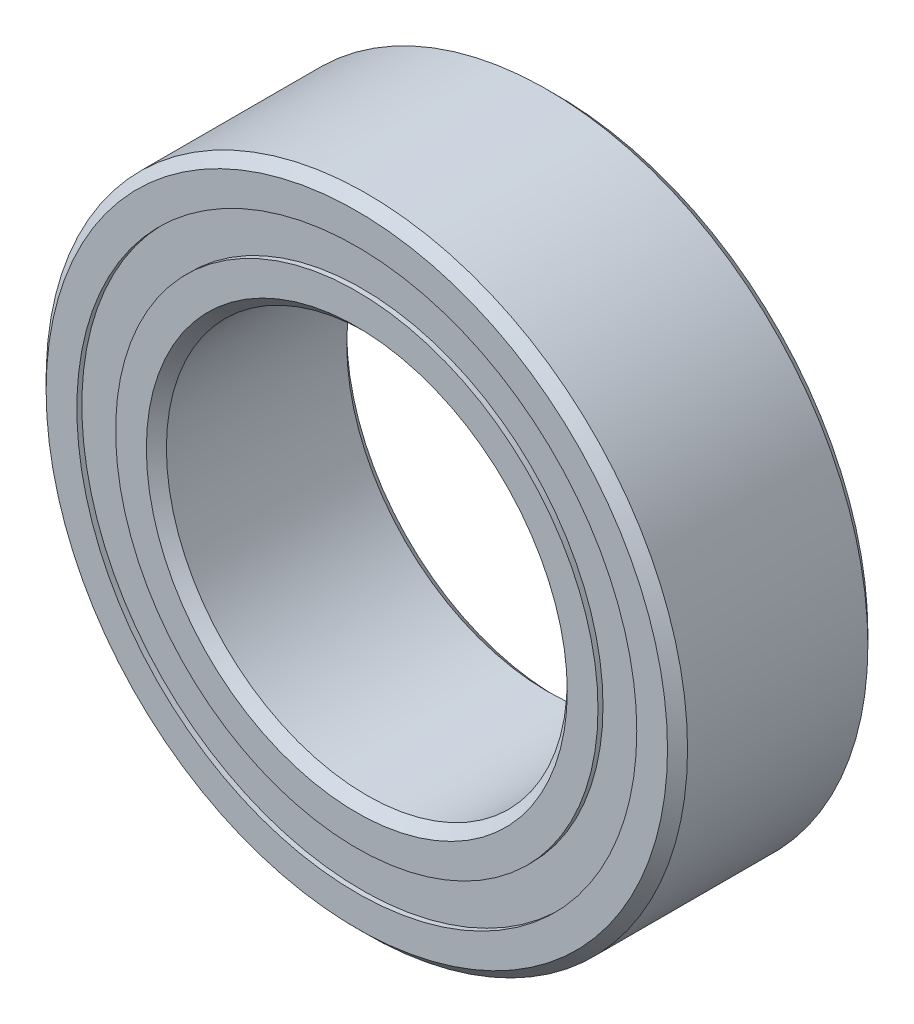
ISO-10303-21;
HEADER;
FILE_DESCRIPTION(('STEP AP214'),'2;1');
FILE_NAME('part.step','',(''),(''),'','','');
FILE_SCHEMA(('AUTOMOTIVE_DESIGN { 1 0 10303 214 1 1 1 1 }'));
ENDSEC;
DATA;
#1=APPLICATION_CONTEXT('core data for automotive mechanical design processes');
#2=APPLICATION_PROTOCOL_DEFINITION('international standard','automotive_design',2000,#1);
#3=PRODUCT_CONTEXT('',#1,'mechanical');
#4=PRODUCT('Part','Part','',(#3));
#5=PRODUCT_RELATED_PRODUCT_CATEGORY('part','',(#4));
#6=PRODUCT_DEFINITION_FORMATION('','',#4);
#7=PRODUCT_DEFINITION_CONTEXT('part definition',#1,'design');
#8=PRODUCT_DEFINITION('design','',#6,#7);
#9=PRODUCT_DEFINITION_SHAPE('','',#8);
#10=(LENGTH_UNIT() NAMED_UNIT(*) SI_UNIT(.MILLI.,.METRE.));
#11=(NAMED_UNIT(*) PLANE_ANGLE_UNIT() SI_UNIT($,.RADIAN.));
#12=(NAMED_UNIT(*) SI_UNIT($,.STERADIAN.) SOLID_ANGLE_UNIT());
#13=UNCERTAINTY_MEASURE_WITH_UNIT(LENGTH_MEASURE(1.E-05),#10,'distance_accuracy_value','');
#14=(GEOMETRIC_REPRESENTATION_CONTEXT(3) GLOBAL_UNCERTAINTY_ASSIGNED_CONTEXT((#13)) GLOBAL_UNIT_ASSIGNED_CONTEXT((#10,
#11,#12)) REPRESENTATION_CONTEXT('',''));
#15=CARTESIAN_POINT('',(0.,0.,0.));
#16=DIRECTION('',(0.,0.,1.));
#17=DIRECTION('',(1.,0.,0.));
#18=AXIS2_PLACEMENT_3D('',#15,#16,#17);
#19=CARTESIAN_POINT('',(0.,5.54322203296703,-1.884553));
#20=DIRECTION('',(0.,0.,1.));
#21=DIRECTION('',(1.,0.,0.));
#22=AXIS2_PLACEMENT_3D('',#19,#20,#21);
#23=PLANE('',#22);
#24=CARTESIAN_POINT('',(0.,0.,-1.884553));
#25=DIRECTION('',(0.,0.,1.));
#26=DIRECTION('',(1.,0.,0.));
#27=AXIS2_PLACEMENT_3D('',#24,#25,#26);
#28=CIRCLE('',#27,5.54322203296703);
#29=CARTESIAN_POINT('',(5.54322203296703,0.,-1.884553));
#30=VERTEX_POINT('',#29);
#31=EDGE_CURVE('E56',#30,#30,#28,.T.);
#32=ORIENTED_EDGE('',*,*,#31,.F.);
#33=EDGE_LOOP('',(#32));
#34=FACE_BOUND('',#33,.T.);
#35=CARTESIAN_POINT('',(0.,0.,-1.884553));
#36=DIRECTION('',(0.,0.,1.));
#37=DIRECTION('',(1.,0.,0.));
#38=AXIS2_PLACEMENT_3D('',#35,#36,#37);
#39=CIRCLE('',#38,4.77552796703297);
#40=CARTESIAN_POINT('',(4.77552796703297,0.,-1.884553));
#41=VERTEX_POINT('',#40);
#42=EDGE_CURVE('E11',#41,#41,#39,.T.);
#43=ORIENTED_EDGE('',*,*,#42,.T.);
#44=EDGE_LOOP('',(#43));
#45=FACE_BOUND('',#44,.T.);
#46=ADVANCED_FACE('F42',(#34,#45),#23,.F.);
#47=CARTESIAN_POINT('',(0.,0.,1.98374));
#48=DIRECTION('',(0.,0.,1.));
#49=DIRECTION('',(1.,0.,0.));
#50=AXIS2_PLACEMENT_3D('',#47,#48,#49);
#51=CYLINDRICAL_SURFACE('',#50,4.77552796703297);
#52=ORIENTED_EDGE('',*,*,#42,.F.);
#53=EDGE_LOOP('',(#52));
#54=FACE_BOUND('',#53,.T.);
#55=CARTESIAN_POINT('',(0.,0.,-0.961595974831125));
#56=DIRECTION('',(0.,0.,1.));
#57=DIRECTION('',(1.,0.,0.));
#58=AXIS2_PLACEMENT_3D('',#55,#56,#57);
#59=CIRCLE('',#58,4.77552796703297);
#60=CARTESIAN_POINT('',(4.77552796703297,0.,-0.961595974831125));
#61=VERTEX_POINT('',#60);
#62=EDGE_CURVE('E48',#61,#61,#59,.T.);
#63=ORIENTED_EDGE('',*,*,#62,.T.);
#64=EDGE_LOOP('',(#63));
#65=FACE_BOUND('',#64,.T.);
#66=ADVANCED_FACE('F65',(#54,#65),#51,.F.);
#67=CARTESIAN_POINT('',(0.,5.54322203296703,-0.961595974831125));
#68=DIRECTION('',(0.,0.,-1.));
#69=DIRECTION('',(-1.,0.,0.));
#70=AXIS2_PLACEMENT_3D('',#67,#68,#69);
#71=PLANE('',#70);
#72=ORIENTED_EDGE('',*,*,#62,.F.);
#73=EDGE_LOOP('',(#72));
#74=FACE_BOUND('',#73,.T.);
#75=CARTESIAN_POINT('',(0.,0.,-0.961595974831125));
#76=DIRECTION('',(0.,0.,1.));
#77=DIRECTION('',(1.,0.,0.));
#78=AXIS2_PLACEMENT_3D('',#75,#76,#77);
#79=CIRCLE('',#78,5.54322203296703);
#80=CARTESIAN_POINT('',(5.54322203296703,0.,-0.961595974831125));
#81=VERTEX_POINT('',#80);
#82=EDGE_CURVE('E52',#81,#81,#79,.T.);
#83=ORIENTED_EDGE('',*,*,#82,.T.);
#84=EDGE_LOOP('',(#83));
#85=FACE_BOUND('',#84,.T.);
#86=ADVANCED_FACE('F69',(#74,#85),#71,.F.);
#87=CARTESIAN_POINT('',(0.,0.,1.98374));
#88=DIRECTION('',(0.,0.,1.));
#89=DIRECTION('',(1.,0.,0.));
#90=AXIS2_PLACEMENT_3D('',#87,#88,#89);
#91=CYLINDRICAL_SURFACE('',#90,5.54322203296703);
#92=ORIENTED_EDGE('',*,*,#82,.F.);
#93=EDGE_LOOP('',(#92));
#94=FACE_BOUND('',#93,.T.);
#95=ORIENTED_EDGE('',*,*,#31,.T.);
#96=EDGE_LOOP('',(#95));
#97=FACE_BOUND('',#96,.T.);
#98=ADVANCED_FACE('F62',(#94,#97),#91,.T.);
#99=CLOSED_SHELL('',(#46,#66,#86,#98));
#100=MANIFOLD_SOLID_BREP('B2',#99);
#101=CARTESIAN_POINT('',(0.,5.54322203296703,1.884553));
#102=DIRECTION('',(0.,0.,-1.));
#103=DIRECTION('',(-1.,0.,0.));
#104=AXIS2_PLACEMENT_3D('',#101,#102,#103);
#105=PLANE('',#104);
#106=CARTESIAN_POINT('',(0.,0.,1.884553));
#107=DIRECTION('',(0.,0.,1.));
#108=DIRECTION('',(1.,0.,0.));
#109=AXIS2_PLACEMENT_3D('',#106,#107,#108);
#110=CIRCLE('',#109,4.77552796703297);
#111=CARTESIAN_POINT('',(4.77552796703297,0.,1.884553));
#112=VERTEX_POINT('',#111);
#113=EDGE_CURVE('E41',#112,#112,#110,.T.);
#114=ORIENTED_EDGE('',*,*,#113,.F.);
#115=EDGE_LOOP('',(#114));
#116=FACE_BOUND('',#115,.T.);
#117=CARTESIAN_POINT('',(0.,0.,1.884553));
#118=DIRECTION('',(0.,0.,1.));
#119=DIRECTION('',(1.,0.,0.));
#120=AXIS2_PLACEMENT_3D('',#117,#118,#119);
#121=CIRCLE('',#120,5.54322203296703);
#122=CARTESIAN_POINT('',(5.54322203296703,0.,1.884553));
#123=VERTEX_POINT('',#122);
#124=EDGE_CURVE('E124',#123,#123,#121,.T.);
#125=ORIENTED_EDGE('',*,*,#124,.T.);
#126=EDGE_LOOP('',(#125));
#127=FACE_BOUND('',#126,.T.);
#128=ADVANCED_FACE('F110',(#116,#127),#105,.F.);
#129=CARTESIAN_POINT('',(0.,0.,1.98374));
#130=DIRECTION('',(0.,0.,1.));
#131=DIRECTION('',(1.,0.,0.));
#132=AXIS2_PLACEMENT_3D('',#129,#130,#131);
#133=CYLINDRICAL_SURFACE('',#132,4.77552796703297);
#134=CARTESIAN_POINT('',(0.,0.,0.961595974831124));
#135=DIRECTION('',(0.,0.,1.));
#136=DIRECTION('',(1.,0.,0.));
#137=AXIS2_PLACEMENT_3D('',#134,#135,#136);
#138=CIRCLE('',#137,4.77552796703297);
#139=CARTESIAN_POINT('',(4.77552796703297,0.,0.961595974831124));
#140=VERTEX_POINT('',#139);
#141=EDGE_CURVE('E116',#140,#140,#138,.T.);
#142=ORIENTED_EDGE('',*,*,#141,.F.);
#143=EDGE_LOOP('',(#142));
#144=FACE_BOUND('',#143,.T.);
#145=ORIENTED_EDGE('',*,*,#113,.T.);
#146=EDGE_LOOP('',(#145));
#147=FACE_BOUND('',#146,.T.);
#148=ADVANCED_FACE('F139',(#144,#147),#133,.F.);
#149=CARTESIAN_POINT('',(0.,5.54322203296703,0.961595974831124));
#150=DIRECTION('',(0.,0.,1.));
#151=DIRECTION('',(1.,0.,0.));
#152=AXIS2_PLACEMENT_3D('',#149,#150,#151);
#153=PLANE('',#152);
#154=CARTESIAN_POINT('',(0.,0.,0.961595974831124));
#155=DIRECTION('',(0.,0.,1.));
#156=DIRECTION('',(1.,0.,0.));
#157=AXIS2_PLACEMENT_3D('',#154,#155,#156);
#158=CIRCLE('',#157,5.54322203296703);
#159=CARTESIAN_POINT('',(5.54322203296703,0.,0.961595974831124));
#160=VERTEX_POINT('',#159);
#161=EDGE_CURVE('E120',#160,#160,#158,.T.);
#162=ORIENTED_EDGE('',*,*,#161,.F.);
#163=EDGE_LOOP('',(#162));
#164=FACE_BOUND('',#163,.T.);
#165=ORIENTED_EDGE('',*,*,#141,.T.);
#166=EDGE_LOOP('',(#165));
#167=FACE_BOUND('',#166,.T.);
#168=ADVANCED_FACE('F134',(#164,#167),#153,.F.);
#169=CARTESIAN_POINT('',(0.,0.,1.98374));
#170=DIRECTION('',(0.,0.,1.));
#171=DIRECTION('',(1.,0.,0.));
#172=AXIS2_PLACEMENT_3D('',#169,#170,#171);
#173=CYLINDRICAL_SURFACE('',#172,5.54322203296703);
#174=ORIENTED_EDGE('',*,*,#124,.F.);
#175=EDGE_LOOP('',(#174));
#176=FACE_BOUND('',#175,.T.);
#177=ORIENTED_EDGE('',*,*,#161,.T.);
#178=EDGE_LOOP('',(#177));
#179=FACE_BOUND('',#178,.T.);
#180=ADVANCED_FACE('F131',(#176,#179),#173,.T.);
#181=CLOSED_SHELL('',(#128,#148,#168,#180));
#182=MANIFOLD_SOLID_BREP('B6',#181);
#183=CARTESIAN_POINT('',(-1.97440733385857,4.76664096305045,0.));
#184=DIRECTION('',(0.,0.,1.));
#185=DIRECTION('',(0.382683432365077,-0.923879532511292,0.));
#186=AXIS2_PLACEMENT_3D('',#183,#184,#185);
#187=SPHERICAL_SURFACE('',#186,0.961595974831125);
#188=CARTESIAN_POINT('',(-1.97440733385857,4.76664096305045,0.961595974831125));
#189=VERTEX_POINT('',#188);
#190=VERTEX_LOOP('',#189);
#191=FACE_BOUND('',#190,.T.);
#192=ADVANCED_FACE('F177',(#191),#187,.T.);
#193=CLOSED_SHELL('',(#192));
#194=MANIFOLD_SOLID_BREP('B36',#193);
#195=CARTESIAN_POINT('',(-3.6482290491843,3.64822904918439,0.));
#196=DIRECTION('',(0.,0.,1.));
#197=DIRECTION('',(0.707106781186539,-0.707106781186556,0.));
#198=AXIS2_PLACEMENT_3D('',#195,#196,#197);
#199=SPHERICAL_SURFACE('',#198,0.961595974831125);
#200=CARTESIAN_POINT('',(-3.6482290491843,3.64822904918439,0.961595974831125));
#201=VERTEX_POINT('',#200);
#202=VERTEX_LOOP('',#201);
#203=FACE_BOUND('',#202,.T.);
#204=ADVANCED_FACE('F197',(#203),#199,.T.);
#205=CLOSED_SHELL('',(#204));
#206=MANIFOLD_SOLID_BREP('B106',#205);
#207=CARTESIAN_POINT('',(-4.7666409630504,1.97440733385869,0.));
#208=DIRECTION('',(0.,0.,1.));
#209=DIRECTION('',(0.923879532511283,-0.3826834323651,0.));
#210=AXIS2_PLACEMENT_3D('',#207,#208,#209);
#211=SPHERICAL_SURFACE('',#210,0.961595974831125);
#212=CARTESIAN_POINT('',(-4.7666409630504,1.97440733385869,0.961595974831125));
#213=VERTEX_POINT('',#212);
#214=VERTEX_LOOP('',#213);
#215=FACE_BOUND('',#214,.T.);
#216=ADVANCED_FACE('F217',(#215),#211,.T.);
#217=CLOSED_SHELL('',(#216));
#218=MANIFOLD_SOLID_BREP('B173',#217);
#219=CARTESIAN_POINT('',(-5.159375,0.,0.));
#220=DIRECTION('',(0.,0.,1.));
#221=DIRECTION('',(1.,0.,0.));
#222=AXIS2_PLACEMENT_3D('',#219,#220,#221);
#223=SPHERICAL_SURFACE('',#222,0.961595974831125);
#224=CARTESIAN_POINT('',(-5.159375,0.,0.961595974831125));
#225=VERTEX_POINT('',#224);
#226=VERTEX_LOOP('',#225);
#227=FACE_BOUND('',#226,.T.);
#228=ADVANCED_FACE('F237',(#227),#223,.T.);
#229=CLOSED_SHELL('',(#228));
#230=MANIFOLD_SOLID_BREP('B193',#229);
#231=CARTESIAN_POINT('',(-4.76664096305044,-1.97440733385859,0.));
#232=DIRECTION('',(0.,0.,1.));
#233=DIRECTION('',(0.923879532511291,0.382683432365081,0.));
#234=AXIS2_PLACEMENT_3D('',#231,#232,#233);
#235=SPHERICAL_SURFACE('',#234,0.961595974831125);
#236=CARTESIAN_POINT('',(-4.76664096305044,-1.97440733385859,0.961595974831125));
#237=VERTEX_POINT('',#236);
#238=VERTEX_LOOP('',#237);
#239=FACE_BOUND('',#238,.T.);
#240=ADVANCED_FACE('F257',(#239),#235,.T.);
#241=CLOSED_SHELL('',(#240));
#242=MANIFOLD_SOLID_BREP('B213',#241);
#243=CARTESIAN_POINT('',(-3.64822904918437,-3.64822904918431,0.));
#244=DIRECTION('',(0.,0.,1.));
#245=DIRECTION('',(0.707106781186554,0.707106781186541,0.));
#246=AXIS2_PLACEMENT_3D('',#243,#244,#245);
#247=SPHERICAL_SURFACE('',#246,0.961595974831125);
#248=CARTESIAN_POINT('',(-3.64822904918437,-3.64822904918431,0.961595974831125));
#249=VERTEX_POINT('',#248);
#250=VERTEX_LOOP('',#249);
#251=FACE_BOUND('',#250,.T.);
#252=ADVANCED_FACE('F277',(#251),#247,.T.);
#253=CLOSED_SHELL('',(#252));
#254=MANIFOLD_SOLID_BREP('B233',#253);
#255=CARTESIAN_POINT('',(-1.97440733385867,-4.7666409630504,0.));
#256=DIRECTION('',(0.,0.,1.));
#257=DIRECTION('',(0.382683432365097,0.923879532511284,0.));
#258=AXIS2_PLACEMENT_3D('',#255,#256,#257);
#259=SPHERICAL_SURFACE('',#258,0.961595974831125);
#260=CARTESIAN_POINT('',(-1.97440733385867,-4.7666409630504,0.961595974831125));
#261=VERTEX_POINT('',#260);
#262=VERTEX_LOOP('',#261);
#263=FACE_BOUND('',#262,.T.);
#264=ADVANCED_FACE('F297',(#263),#259,.T.);
#265=CLOSED_SHELL('',(#264));
#266=MANIFOLD_SOLID_BREP('B253',#265);
#267=CARTESIAN_POINT('',(0.,-5.159375,0.));
#268=DIRECTION('',(0.,0.,1.));
#269=DIRECTION('',(0.,1.,0.));
#270=AXIS2_PLACEMENT_3D('',#267,#268,#269);
#271=SPHERICAL_SURFACE('',#270,0.961595974831125);
#272=CARTESIAN_POINT('',(0.,-5.159375,0.961595974831125));
#273=VERTEX_POINT('',#272);
#274=VERTEX_LOOP('',#273);
#275=FACE_BOUND('',#274,.T.);
#276=ADVANCED_FACE('F317',(#275),#271,.T.);
#277=CLOSED_SHELL('',(#276));
#278=MANIFOLD_SOLID_BREP('B273',#277);
#279=CARTESIAN_POINT('',(1.97440733385861,-4.76664096305043,0.));
#280=DIRECTION('',(0.,0.,1.));
#281=DIRECTION('',(-0.382683432365084,0.923879532511289,0.));
#282=AXIS2_PLACEMENT_3D('',#279,#280,#281);
#283=SPHERICAL_SURFACE('',#282,0.961595974831125);
#284=CARTESIAN_POINT('',(1.97440733385861,-4.76664096305043,0.961595974831125));
#285=VERTEX_POINT('',#284);
#286=VERTEX_LOOP('',#285);
#287=FACE_BOUND('',#286,.T.);
#288=ADVANCED_FACE('F337',(#287),#283,.T.);
#289=CLOSED_SHELL('',(#288));
#290=MANIFOLD_SOLID_BREP('B293',#289);
#291=CARTESIAN_POINT('',(3.64822904918432,-3.64822904918436,0.));
#292=DIRECTION('',(0.,0.,1.));
#293=DIRECTION('',(-0.707106781186544,0.707106781186551,0.));
#294=AXIS2_PLACEMENT_3D('',#291,#292,#293);
#295=SPHERICAL_SURFACE('',#294,0.961595974831125);
#296=CARTESIAN_POINT('',(3.64822904918432,-3.64822904918436,0.961595974831125));
#297=VERTEX_POINT('',#296);
#298=VERTEX_LOOP('',#297);
#299=FACE_BOUND('',#298,.T.);
#300=ADVANCED_FACE('F357',(#299),#295,.T.);
#301=CLOSED_SHELL('',(#300));
#302=MANIFOLD_SOLID_BREP('B313',#301);
#303=CARTESIAN_POINT('',(4.76664096305041,-1.97440733385866,0.));
#304=DIRECTION('',(0.,0.,1.));
#305=DIRECTION('',(-0.923879532511285,0.382683432365094,0.));
#306=AXIS2_PLACEMENT_3D('',#303,#304,#305);
#307=SPHERICAL_SURFACE('',#306,0.961595974831125);
#308=CARTESIAN_POINT('',(4.76664096305041,-1.97440733385866,0.961595974831125));
#309=VERTEX_POINT('',#308);
#310=VERTEX_LOOP('',#309);
#311=FACE_BOUND('',#310,.T.);
#312=ADVANCED_FACE('F377',(#311),#307,.T.);
#313=CLOSED_SHELL('',(#312));
#314=MANIFOLD_SOLID_BREP('B333',#313);
#315=CARTESIAN_POINT('',(5.159375,0.,0.));
#316=DIRECTION('',(0.,0.,1.));
#317=DIRECTION('',(-1.,0.,0.));
#318=AXIS2_PLACEMENT_3D('',#315,#316,#317);
#319=SPHERICAL_SURFACE('',#318,0.961595974831125);
#320=CARTESIAN_POINT('',(5.159375,0.,0.961595974831125));
#321=VERTEX_POINT('',#320);
#322=VERTEX_LOOP('',#321);
#323=FACE_BOUND('',#322,.T.);
#324=ADVANCED_FACE('F397',(#323),#319,.T.);
#325=CLOSED_SHELL('',(#324));
#326=MANIFOLD_SOLID_BREP('B353',#325);
#327=CARTESIAN_POINT('',(4.76664096305042,1.97440733385862,0.));
#328=DIRECTION('',(0.,0.,1.));
#329=DIRECTION('',(-0.923879532511288,-0.382683432365087,0.));
#330=AXIS2_PLACEMENT_3D('',#327,#328,#329);
#331=SPHERICAL_SURFACE('',#330,0.961595974831125);
#332=CARTESIAN_POINT('',(4.76664096305042,1.97440733385862,0.961595974831125));
#333=VERTEX_POINT('',#332);
#334=VERTEX_LOOP('',#333);
#335=FACE_BOUND('',#334,.T.);
#336=ADVANCED_FACE('F417',(#335),#331,.T.);
#337=CLOSED_SHELL('',(#336));
#338=MANIFOLD_SOLID_BREP('B373',#337);
#339=CARTESIAN_POINT('',(3.64822904918435,3.64822904918434,0.));
#340=DIRECTION('',(0.,0.,1.));
#341=DIRECTION('',(-0.707106781186549,-0.707106781186546,0.));
#342=AXIS2_PLACEMENT_3D('',#339,#340,#341);
#343=SPHERICAL_SURFACE('',#342,0.961595974831125);
#344=CARTESIAN_POINT('',(3.64822904918435,3.64822904918434,0.961595974831125));
#345=VERTEX_POINT('',#344);
#346=VERTEX_LOOP('',#345);
#347=FACE_BOUND('',#346,.T.);
#348=ADVANCED_FACE('F437',(#347),#343,.T.);
#349=CLOSED_SHELL('',(#348));
#350=MANIFOLD_SOLID_BREP('B393',#349);
#351=CARTESIAN_POINT('',(1.97440733385864,4.76664096305042,0.));
#352=DIRECTION('',(0.,0.,1.));
#353=DIRECTION('',(-0.382683432365091,-0.923879532511287,0.));
#354=AXIS2_PLACEMENT_3D('',#351,#352,#353);
#355=SPHERICAL_SURFACE('',#354,0.961595974831125);
#356=CARTESIAN_POINT('',(1.97440733385864,4.76664096305042,0.961595974831125));
#357=VERTEX_POINT('',#356);
#358=VERTEX_LOOP('',#357);
#359=FACE_BOUND('',#358,.T.);
#360=ADVANCED_FACE('F457',(#359),#355,.T.);
#361=CLOSED_SHELL('',(#360));
#362=MANIFOLD_SOLID_BREP('B413',#361);
#363=CARTESIAN_POINT('',(0.,5.159375,0.));
#364=DIRECTION('',(0.,0.,1.));
#365=DIRECTION('',(0.,-1.,0.));
#366=AXIS2_PLACEMENT_3D('',#363,#364,#365);
#367=SPHERICAL_SURFACE('',#366,0.961595974831125);
#368=CARTESIAN_POINT('',(0.,5.159375,0.961595974831125));
#369=VERTEX_POINT('',#368);
#370=VERTEX_LOOP('',#369);
#371=FACE_BOUND('',#370,.T.);
#372=ADVANCED_FACE('F480',(#371),#367,.T.);
#373=CLOSED_SHELL('',(#372));
#374=MANIFOLD_SOLID_BREP('B433',#373);
#375=CARTESIAN_POINT('',(0.,4.77552796703297,1.98374));
#376=DIRECTION('',(0.,0.,-1.));
#377=DIRECTION('',(-1.,0.,0.));
#378=AXIS2_PLACEMENT_3D('',#375,#376,#377);
#379=PLANE('',#378);
#380=CARTESIAN_POINT('',(0.,0.,1.98374));
#381=DIRECTION('',(0.,0.,1.));
#382=DIRECTION('',(1.,0.,0.));
#383=AXIS2_PLACEMENT_3D('',#380,#381,#382);
#384=CIRCLE('',#383,4.167124);
#385=CARTESIAN_POINT('',(4.167124,0.,1.98374));
#386=VERTEX_POINT('',#385);
#387=EDGE_CURVE('E528',#386,#386,#384,.T.);
#388=ORIENTED_EDGE('',*,*,#387,.F.);
#389=EDGE_LOOP('',(#388));
#390=FACE_BOUND('',#389,.T.);
#391=CARTESIAN_POINT('',(0.,0.,1.98374));
#392=DIRECTION('',(0.,0.,1.));
#393=DIRECTION('',(1.,0.,0.));
#394=AXIS2_PLACEMENT_3D('',#391,#392,#393);
#395=CIRCLE('',#394,4.77552796703297);
#396=CARTESIAN_POINT('',(4.77552796703297,0.,1.98374));
#397=VERTEX_POINT('',#396);
#398=EDGE_CURVE('E479',#397,#397,#395,.T.);
#399=ORIENTED_EDGE('',*,*,#398,.T.);
#400=EDGE_LOOP('',(#399));
#401=FACE_BOUND('',#400,.T.);
#402=ADVANCED_FACE('F500',(#390,#401),#379,.F.);
#403=CARTESIAN_POINT('',(0.,0.,1.98374));
#404=DIRECTION('',(0.,0.,1.));
#405=DIRECTION('',(1.,0.,0.));
#406=AXIS2_PLACEMENT_3D('',#403,#404,#405);
#407=CYLINDRICAL_SURFACE('',#406,4.77552796703297);
#408=ORIENTED_EDGE('',*,*,#398,.F.);
#409=EDGE_LOOP('',(#408));
#410=FACE_BOUND('',#409,.T.);
#411=CARTESIAN_POINT('',(0.,0.,0.881662222222222));
#412=DIRECTION('',(0.,0.,1.));
#413=DIRECTION('',(1.,0.,0.));
#414=AXIS2_PLACEMENT_3D('',#411,#412,#413);
#415=CIRCLE('',#414,4.77552796703297);
#416=CARTESIAN_POINT('',(4.77552796703297,0.,0.881662222222222));
#417=VERTEX_POINT('',#416);
#418=EDGE_CURVE('E506',#417,#417,#415,.T.);
#419=ORIENTED_EDGE('',*,*,#418,.T.);
#420=EDGE_LOOP('',(#419));
#421=FACE_BOUND('',#420,.T.);
#422=ADVANCED_FACE('F535',(#410,#421),#407,.T.);
#423=CARTESIAN_POINT('',(0.,0.,0.));
#424=DIRECTION('',(0.,0.,1.));
#425=DIRECTION('',(1.,0.,0.));
#426=AXIS2_PLACEMENT_3D('',#423,#424,#425);
#427=TOROIDAL_SURFACE('',#426,5.15937499999999,0.961595974831123);
#428=ORIENTED_EDGE('',*,*,#418,.F.);
#429=EDGE_LOOP('',(#428));
#430=FACE_BOUND('',#429,.T.);
#431=CARTESIAN_POINT('',(0.,0.,-0.881662222222224));
#432=DIRECTION('',(0.,0.,1.));
#433=DIRECTION('',(1.,0.,0.));
#434=AXIS2_PLACEMENT_3D('',#431,#432,#433);
#435=CIRCLE('',#434,4.77552796703297);
#436=CARTESIAN_POINT('',(4.77552796703297,0.,-0.881662222222224));
#437=VERTEX_POINT('',#436);
#438=EDGE_CURVE('E510',#437,#437,#435,.T.);
#439=ORIENTED_EDGE('',*,*,#438,.T.);
#440=EDGE_LOOP('',(#439));
#441=FACE_BOUND('',#440,.T.);
#442=ADVANCED_FACE('F539',(#430,#441),#427,.F.);
#443=CARTESIAN_POINT('',(0.,0.,1.98374));
#444=DIRECTION('',(0.,0.,1.));
#445=DIRECTION('',(1.,0.,0.));
#446=AXIS2_PLACEMENT_3D('',#443,#444,#445);
#447=CYLINDRICAL_SURFACE('',#446,4.77552796703297);
#448=ORIENTED_EDGE('',*,*,#438,.F.);
#449=EDGE_LOOP('',(#448));
#450=FACE_BOUND('',#449,.T.);
#451=CARTESIAN_POINT('',(0.,0.,-1.98374));
#452=DIRECTION('',(0.,0.,1.));
#453=DIRECTION('',(1.,0.,0.));
#454=AXIS2_PLACEMENT_3D('',#451,#452,#453);
#455=CIRCLE('',#454,4.77552796703297);
#456=CARTESIAN_POINT('',(4.77552796703297,0.,-1.98374));
#457=VERTEX_POINT('',#456);
#458=EDGE_CURVE('E514',#457,#457,#455,.T.);
#459=ORIENTED_EDGE('',*,*,#458,.T.);
#460=EDGE_LOOP('',(#459));
#461=FACE_BOUND('',#460,.T.);
#462=ADVANCED_FACE('F544',(#450,#461),#447,.T.);
#463=CARTESIAN_POINT('',(0.,4.167124,-1.98374));
#464=DIRECTION('',(0.,0.,1.));
#465=DIRECTION('',(1.,0.,0.));
#466=AXIS2_PLACEMENT_3D('',#463,#464,#465);
#467=PLANE('',#466);
#468=ORIENTED_EDGE('',*,*,#458,.F.);
#469=EDGE_LOOP('',(#468));
#470=FACE_BOUND('',#469,.T.);
#471=CARTESIAN_POINT('',(0.,0.,-1.98374));
#472=DIRECTION('',(0.,0.,1.));
#473=DIRECTION('',(1.,0.,0.));
#474=AXIS2_PLACEMENT_3D('',#471,#472,#473);
#475=CIRCLE('',#474,4.167124);
#476=CARTESIAN_POINT('',(4.167124,0.,-1.98374));
#477=VERTEX_POINT('',#476);
#478=EDGE_CURVE('E519',#477,#477,#475,.T.);
#479=ORIENTED_EDGE('',*,*,#478,.T.);
#480=EDGE_LOOP('',(#479));
#481=FACE_BOUND('',#480,.T.);
#482=ADVANCED_FACE('F550',(#470,#481),#467,.F.);
#483=CARTESIAN_POINT('',(0.,0.,-1.785366));
#484=DIRECTION('',(0.,0.,-1.));
#485=DIRECTION('',(-1.,0.,0.));
#486=AXIS2_PLACEMENT_3D('',#483,#484,#485);
#487=CONICAL_SURFACE('',#486,3.96875,0.785398163397448);
#488=ORIENTED_EDGE('',*,*,#478,.F.);
#489=EDGE_LOOP('',(#488));
#490=FACE_BOUND('',#489,.T.);
#491=CARTESIAN_POINT('',(0.,0.,-1.785366));
#492=DIRECTION('',(0.,0.,1.));
#493=DIRECTION('',(1.,0.,0.));
#494=AXIS2_PLACEMENT_3D('',#491,#492,#493);
#495=CIRCLE('',#494,3.96875);
#496=CARTESIAN_POINT('',(3.96875,0.,-1.785366));
#497=VERTEX_POINT('',#496);
#498=EDGE_CURVE('E522',#497,#497,#495,.T.);
#499=ORIENTED_EDGE('',*,*,#498,.T.);
#500=EDGE_LOOP('',(#499));
#501=FACE_BOUND('',#500,.T.);
#502=ADVANCED_FACE('F554',(#490,#501),#487,.F.);
#503=CARTESIAN_POINT('',(0.,0.,1.98374));
#504=DIRECTION('',(0.,0.,1.));
#505=DIRECTION('',(1.,0.,0.));
#506=AXIS2_PLACEMENT_3D('',#503,#504,#505);
#507=CYLINDRICAL_SURFACE('',#506,3.96875);
#508=ORIENTED_EDGE('',*,*,#498,.F.);
#509=EDGE_LOOP('',(#508));
#510=FACE_BOUND('',#509,.T.);
#511=CARTESIAN_POINT('',(0.,0.,1.785366));
#512=DIRECTION('',(0.,0.,1.));
#513=DIRECTION('',(1.,0.,0.));
#514=AXIS2_PLACEMENT_3D('',#511,#512,#513);
#515=CIRCLE('',#514,3.96875);
#516=CARTESIAN_POINT('',(3.96875,0.,1.785366));
#517=VERTEX_POINT('',#516);
#518=EDGE_CURVE('E525',#517,#517,#515,.T.);
#519=ORIENTED_EDGE('',*,*,#518,.T.);
#520=EDGE_LOOP('',(#519));
#521=FACE_BOUND('',#520,.T.);
#522=ADVANCED_FACE('F558',(#510,#521),#507,.F.);
#523=CARTESIAN_POINT('',(0.,0.,1.98374));
#524=DIRECTION('',(0.,0.,1.));
#525=DIRECTION('',(1.,0.,0.));
#526=AXIS2_PLACEMENT_3D('',#523,#524,#525);
#527=CONICAL_SURFACE('',#526,4.167124,0.785398163397449);
#528=ORIENTED_EDGE('',*,*,#518,.F.);
#529=EDGE_LOOP('',(#528));
#530=FACE_BOUND('',#529,.T.);
#531=ORIENTED_EDGE('',*,*,#387,.T.);
#532=EDGE_LOOP('',(#531));
#533=FACE_BOUND('',#532,.T.);
#534=ADVANCED_FACE('F532',(#530,#533),#527,.F.);
#535=CLOSED_SHELL('',(#402,#422,#442,#462,#482,#502,#522,#534));
#536=MANIFOLD_SOLID_BREP('B453',#535);
#537=CARTESIAN_POINT('',(0.,0.,1.785366));
#538=DIRECTION('',(0.,0.,-1.));
#539=DIRECTION('',(-1.,0.,0.));
#540=AXIS2_PLACEMENT_3D('',#537,#538,#539);
#541=CONICAL_SURFACE('',#540,6.35,0.785398163397449);
#542=CARTESIAN_POINT('',(0.,0.,1.98374));
#543=DIRECTION('',(0.,0.,1.));
#544=DIRECTION('',(1.,0.,0.));
#545=AXIS2_PLACEMENT_3D('',#542,#543,#544);
#546=CIRCLE('',#545,6.151626);
#547=CARTESIAN_POINT('',(6.151626,0.,1.98374));
#548=VERTEX_POINT('',#547);
#549=EDGE_CURVE('E650',#548,#548,#546,.T.);
#550=ORIENTED_EDGE('',*,*,#549,.F.);
#551=EDGE_LOOP('',(#550));
#552=FACE_BOUND('',#551,.T.);
#553=CARTESIAN_POINT('',(0.,0.,1.785366));
#554=DIRECTION('',(0.,0.,1.));
#555=DIRECTION('',(1.,0.,0.));
#556=AXIS2_PLACEMENT_3D('',#553,#554,#555);
#557=CIRCLE('',#556,6.35);
#558=CARTESIAN_POINT('',(6.35,0.,1.785366));
#559=VERTEX_POINT('',#558);
#560=EDGE_CURVE('E499',#559,#559,#557,.T.);
#561=ORIENTED_EDGE('',*,*,#560,.T.);
#562=EDGE_LOOP('',(#561));
#563=FACE_BOUND('',#562,.T.);
#564=ADVANCED_FACE('F622',(#552,#563),#541,.T.);
#565=CARTESIAN_POINT('',(0.,0.,1.98374));
#566=DIRECTION('',(0.,0.,1.));
#567=DIRECTION('',(1.,0.,0.));
#568=AXIS2_PLACEMENT_3D('',#565,#566,#567);
#569=CYLINDRICAL_SURFACE('',#568,6.35);
#570=ORIENTED_EDGE('',*,*,#560,.F.);
#571=EDGE_LOOP('',(#570));
#572=FACE_BOUND('',#571,.T.);
#573=CARTESIAN_POINT('',(0.,0.,-1.785366));
#574=DIRECTION('',(0.,0.,1.));
#575=DIRECTION('',(1.,0.,0.));
#576=AXIS2_PLACEMENT_3D('',#573,#574,#575);
#577=CIRCLE('',#576,6.35);
#578=CARTESIAN_POINT('',(6.35,0.,-1.785366));
#579=VERTEX_POINT('',#578);
#580=EDGE_CURVE('E628',#579,#579,#577,.T.);
#581=ORIENTED_EDGE('',*,*,#580,.T.);
#582=EDGE_LOOP('',(#581));
#583=FACE_BOUND('',#582,.T.);
#584=ADVANCED_FACE('F657',(#572,#583),#569,.T.);
#585=CARTESIAN_POINT('',(0.,0.,-1.98374));
#586=DIRECTION('',(0.,0.,1.));
#587=DIRECTION('',(1.,0.,0.));
#588=AXIS2_PLACEMENT_3D('',#585,#586,#587);
#589=CONICAL_SURFACE('',#588,6.151626,0.785398163397448);
#590=ORIENTED_EDGE('',*,*,#580,.F.);
#591=EDGE_LOOP('',(#590));
#592=FACE_BOUND('',#591,.T.);
#593=CARTESIAN_POINT('',(0.,0.,-1.98374));
#594=DIRECTION('',(0.,0.,1.));
#595=DIRECTION('',(1.,0.,0.));
#596=AXIS2_PLACEMENT_3D('',#593,#594,#595);
#597=CIRCLE('',#596,6.151626);
#598=CARTESIAN_POINT('',(6.151626,0.,-1.98374));
#599=VERTEX_POINT('',#598);
#600=EDGE_CURVE('E632',#599,#599,#597,.T.);
#601=ORIENTED_EDGE('',*,*,#600,.T.);
#602=EDGE_LOOP('',(#601));
#603=FACE_BOUND('',#602,.T.);
#604=ADVANCED_FACE('F661',(#592,#603),#589,.T.);
#605=CARTESIAN_POINT('',(0.,6.151626,-1.98374));
#606=DIRECTION('',(0.,0.,1.));
#607=DIRECTION('',(1.,0.,0.));
#608=AXIS2_PLACEMENT_3D('',#605,#606,#607);
#609=PLANE('',#608);
#610=ORIENTED_EDGE('',*,*,#600,.F.);
#611=EDGE_LOOP('',(#610));
#612=FACE_BOUND('',#611,.T.);
#613=CARTESIAN_POINT('',(0.,0.,-1.98374));
#614=DIRECTION('',(0.,0.,1.));
#615=DIRECTION('',(1.,0.,0.));
#616=AXIS2_PLACEMENT_3D('',#613,#614,#615);
#617=CIRCLE('',#616,5.54322203296703);
#618=CARTESIAN_POINT('',(5.54322203296703,0.,-1.98374));
#619=VERTEX_POINT('',#618);
#620=EDGE_CURVE('E636',#619,#619,#617,.T.);
#621=ORIENTED_EDGE('',*,*,#620,.T.);
#622=EDGE_LOOP('',(#621));
#623=FACE_BOUND('',#622,.T.);
#624=ADVANCED_FACE('F666',(#612,#623),#609,.F.);
#625=CARTESIAN_POINT('',(0.,0.,1.98374));
#626=DIRECTION('',(0.,0.,1.));
#627=DIRECTION('',(1.,0.,0.));
#628=AXIS2_PLACEMENT_3D('',#625,#626,#627);
#629=CYLINDRICAL_SURFACE('',#628,5.54322203296703);
#630=ORIENTED_EDGE('',*,*,#620,.F.);
#631=EDGE_LOOP('',(#630));
#632=FACE_BOUND('',#631,.T.);
#633=CARTESIAN_POINT('',(0.,0.,-0.881662222222222));
#634=DIRECTION('',(0.,0.,1.));
#635=DIRECTION('',(1.,0.,0.));
#636=AXIS2_PLACEMENT_3D('',#633,#634,#635);
#637=CIRCLE('',#636,5.54322203296703);
#638=CARTESIAN_POINT('',(5.54322203296703,0.,-0.881662222222222));
#639=VERTEX_POINT('',#638);
#640=EDGE_CURVE('E641',#639,#639,#637,.T.);
#641=ORIENTED_EDGE('',*,*,#640,.T.);
#642=EDGE_LOOP('',(#641));
#643=FACE_BOUND('',#642,.T.);
#644=ADVANCED_FACE('F672',(#632,#643),#629,.F.);
#645=CARTESIAN_POINT('',(0.,0.,0.));
#646=DIRECTION('',(0.,0.,1.));
#647=DIRECTION('',(1.,0.,0.));
#648=AXIS2_PLACEMENT_3D('',#645,#646,#647);
#649=TOROIDAL_SURFACE('',#648,5.159375,0.961595974831125);
#650=ORIENTED_EDGE('',*,*,#640,.F.);
#651=EDGE_LOOP('',(#650));
#652=FACE_BOUND('',#651,.T.);
#653=CARTESIAN_POINT('',(0.,0.,0.881662222222222));
#654=DIRECTION('',(0.,0.,1.));
#655=DIRECTION('',(1.,0.,0.));
#656=AXIS2_PLACEMENT_3D('',#653,#654,#655);
#657=CIRCLE('',#656,5.54322203296703);
#658=CARTESIAN_POINT('',(5.54322203296703,0.,0.881662222222222));
#659=VERTEX_POINT('',#658);
#660=EDGE_CURVE('E644',#659,#659,#657,.T.);
#661=ORIENTED_EDGE('',*,*,#660,.T.);
#662=EDGE_LOOP('',(#661));
#663=FACE_BOUND('',#662,.T.);
#664=ADVANCED_FACE('F676',(#652,#663),#649,.F.);
#665=CARTESIAN_POINT('',(0.,0.,1.98374));
#666=DIRECTION('',(0.,0.,1.));
#667=DIRECTION('',(1.,0.,0.));
#668=AXIS2_PLACEMENT_3D('',#665,#666,#667);
#669=CYLINDRICAL_SURFACE('',#668,5.54322203296703);
#670=ORIENTED_EDGE('',*,*,#660,.F.);
#671=EDGE_LOOP('',(#670));
#672=FACE_BOUND('',#671,.T.);
#673=CARTESIAN_POINT('',(0.,0.,1.98374));
#674=DIRECTION('',(0.,0.,1.));
#675=DIRECTION('',(1.,0.,0.));
#676=AXIS2_PLACEMENT_3D('',#673,#674,#675);
#677=CIRCLE('',#676,5.54322203296703);
#678=CARTESIAN_POINT('',(5.54322203296703,0.,1.98374));
#679=VERTEX_POINT('',#678);
#680=EDGE_CURVE('E647',#679,#679,#677,.T.);
#681=ORIENTED_EDGE('',*,*,#680,.T.);
#682=EDGE_LOOP('',(#681));
#683=FACE_BOUND('',#682,.T.);
#684=ADVANCED_FACE('F680',(#672,#683),#669,.F.);
#685=CARTESIAN_POINT('',(0.,6.151626,1.98374));
#686=DIRECTION('',(0.,0.,-1.));
#687=DIRECTION('',(-1.,0.,0.));
#688=AXIS2_PLACEMENT_3D('',#685,#686,#687);
#689=PLANE('',#688);
#690=ORIENTED_EDGE('',*,*,#680,.F.);
#691=EDGE_LOOP('',(#690));
#692=FACE_BOUND('',#691,.T.);
#693=ORIENTED_EDGE('',*,*,#549,.T.);
#694=EDGE_LOOP('',(#693));
#695=FACE_BOUND('',#694,.T.);
#696=ADVANCED_FACE('F654',(#692,#695),#689,.F.);
#697=CLOSED_SHELL('',(#564,#584,#604,#624,#644,#664,#684,#696));
#698=MANIFOLD_SOLID_BREP('B474',#697);
#699=ADVANCED_BREP_SHAPE_REPRESENTATION('',(#18,#100,#182,#194,#206,#218,#230,#242,#254,#266,
#278,#290,#302,#314,#326,#338,#350,#362,#374,#536,#698),#14);
#700=SHAPE_DEFINITION_REPRESENTATION(#9,#699);
ENDSEC;
END-ISO-10303-21;
